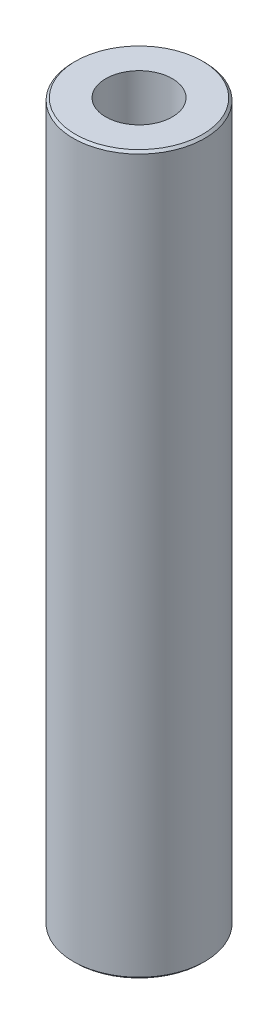
ISO-10303-21;
HEADER;
FILE_DESCRIPTION(('STEP AP214'),'2;1');
FILE_NAME('part.step','',(''),(''),'','','');
FILE_SCHEMA(('AUTOMOTIVE_DESIGN { 1 0 10303 214 1 1 1 1 }'));
ENDSEC;
DATA;
#1=APPLICATION_CONTEXT('core data for automotive mechanical design processes');
#2=APPLICATION_PROTOCOL_DEFINITION('international standard','automotive_design',2000,#1);
#3=PRODUCT_CONTEXT('',#1,'mechanical');
#4=PRODUCT('Part','Part','',(#3));
#5=PRODUCT_RELATED_PRODUCT_CATEGORY('part','',(#4));
#6=PRODUCT_DEFINITION_FORMATION('','',#4);
#7=PRODUCT_DEFINITION_CONTEXT('part definition',#1,'design');
#8=PRODUCT_DEFINITION('design','',#6,#7);
#9=PRODUCT_DEFINITION_SHAPE('','',#8);
#10=(LENGTH_UNIT() NAMED_UNIT(*) SI_UNIT(.MILLI.,.METRE.));
#11=(NAMED_UNIT(*) PLANE_ANGLE_UNIT() SI_UNIT($,.RADIAN.));
#12=(NAMED_UNIT(*) SI_UNIT($,.STERADIAN.) SOLID_ANGLE_UNIT());
#13=UNCERTAINTY_MEASURE_WITH_UNIT(LENGTH_MEASURE(1.E-05),#10,'distance_accuracy_value','');
#14=(GEOMETRIC_REPRESENTATION_CONTEXT(3) GLOBAL_UNCERTAINTY_ASSIGNED_CONTEXT((#13)) GLOBAL_UNIT_ASSIGNED_CONTEXT((#10,
#11,#12)) REPRESENTATION_CONTEXT('',''));
#15=CARTESIAN_POINT('',(0.,0.,0.));
#16=DIRECTION('',(0.,0.,1.));
#17=DIRECTION('',(1.,0.,0.));
#18=AXIS2_PLACEMENT_3D('',#15,#16,#17);
#19=CARTESIAN_POINT('',(0.,600.,0.));
#20=DIRECTION('',(0.,-1.,0.));
#21=DIRECTION('',(0.,0.,-1.));
#22=AXIS2_PLACEMENT_3D('',#19,#20,#21);
#23=CYLINDRICAL_SURFACE('',#22,55.);
#24=CARTESIAN_POINT('',(0.,598.094434389419,0.));
#25=DIRECTION('',(0.,1.,0.));
#26=DIRECTION('',(0.,0.,1.));
#27=AXIS2_PLACEMENT_3D('',#24,#25,#26);
#28=CIRCLE('',#27,55.);
#29=CARTESIAN_POINT('',(0.,598.094434389419,-55.0000000000001));
#30=VERTEX_POINT('',#29);
#31=EDGE_CURVE('E50',#30,#30,#28,.F.);
#32=ORIENTED_EDGE('',*,*,#31,.T.);
#33=EDGE_LOOP('',(#32));
#34=FACE_BOUND('',#33,.T.);
#35=CARTESIAN_POINT('',(0.,1.90556561058108,0.));
#36=DIRECTION('',(0.,1.,0.));
#37=DIRECTION('',(0.,0.,1.));
#38=AXIS2_PLACEMENT_3D('',#35,#36,#37);
#39=CIRCLE('',#38,55.);
#40=CARTESIAN_POINT('',(0.,1.90556561058108,55.));
#41=VERTEX_POINT('',#40);
#42=EDGE_CURVE('E51',#41,#41,#39,.T.);
#43=ORIENTED_EDGE('',*,*,#42,.T.);
#44=EDGE_LOOP('',(#43));
#45=FACE_BOUND('',#44,.T.);
#46=ADVANCED_FACE('F39',(#34,#45),#23,.T.);
#47=CARTESIAN_POINT('',(0.,600.,0.));
#48=DIRECTION('',(0.,1.,0.));
#49=DIRECTION('',(0.,0.,1.));
#50=AXIS2_PLACEMENT_3D('',#47,#48,#49);
#51=PLANE('',#50);
#52=CARTESIAN_POINT('',(0.,600.,0.));
#53=DIRECTION('',(0.,1.,0.));
#54=DIRECTION('',(0.,0.,1.));
#55=AXIS2_PLACEMENT_3D('',#52,#53,#54);
#56=CIRCLE('',#55,53.0944343894191);
#57=CARTESIAN_POINT('',(0.,600.,-53.0944343894192));
#58=VERTEX_POINT('',#57);
#59=EDGE_CURVE('E54',#58,#58,#56,.T.);
#60=ORIENTED_EDGE('',*,*,#59,.T.);
#61=EDGE_LOOP('',(#60));
#62=FACE_BOUND('',#61,.T.);
#63=CARTESIAN_POINT('',(0.,600.,0.));
#64=DIRECTION('',(0.,1.,0.));
#65=DIRECTION('',(0.,0.,1.));
#66=AXIS2_PLACEMENT_3D('',#63,#64,#65);
#67=CIRCLE('',#66,27.8159563151582);
#68=CARTESIAN_POINT('',(0.,600.,27.8159563151582));
#69=VERTEX_POINT('',#68);
#70=EDGE_CURVE('E58',#69,#69,#67,.T.);
#71=ORIENTED_EDGE('',*,*,#70,.F.);
#72=EDGE_LOOP('',(#71));
#73=FACE_BOUND('',#72,.T.);
#74=ADVANCED_FACE('F69',(#62,#73),#51,.T.);
#75=CARTESIAN_POINT('',(0.,0.,0.));
#76=DIRECTION('',(0.,1.,0.));
#77=DIRECTION('',(0.,0.,1.));
#78=AXIS2_PLACEMENT_3D('',#75,#76,#77);
#79=PLANE('',#78);
#80=CARTESIAN_POINT('',(0.,0.,0.));
#81=DIRECTION('',(0.,1.,0.));
#82=DIRECTION('',(0.,0.,1.));
#83=AXIS2_PLACEMENT_3D('',#80,#81,#82);
#84=CIRCLE('',#83,53.0944343894189);
#85=CARTESIAN_POINT('',(0.,0.,53.0944343894189));
#86=VERTEX_POINT('',#85);
#87=EDGE_CURVE('E10',#86,#86,#84,.F.);
#88=ORIENTED_EDGE('',*,*,#87,.T.);
#89=EDGE_LOOP('',(#88));
#90=FACE_BOUND('',#89,.T.);
#91=CARTESIAN_POINT('',(0.,0.,0.));
#92=DIRECTION('',(0.,1.,0.));
#93=DIRECTION('',(0.,0.,1.));
#94=AXIS2_PLACEMENT_3D('',#91,#92,#93);
#95=CIRCLE('',#94,27.8159563151582);
#96=CARTESIAN_POINT('',(0.,0.,27.8159563151582));
#97=VERTEX_POINT('',#96);
#98=EDGE_CURVE('E63',#97,#97,#95,.T.);
#99=ORIENTED_EDGE('',*,*,#98,.T.);
#100=EDGE_LOOP('',(#99));
#101=FACE_BOUND('',#100,.T.);
#102=ADVANCED_FACE('F75',(#90,#101),#79,.F.);
#103=CARTESIAN_POINT('',(0.,600.,0.));
#104=DIRECTION('',(0.,-1.,0.));
#105=DIRECTION('',(0.,0.,-1.));
#106=AXIS2_PLACEMENT_3D('',#103,#104,#105);
#107=CYLINDRICAL_SURFACE('',#106,27.8159563151582);
#108=ORIENTED_EDGE('',*,*,#70,.T.);
#109=EDGE_LOOP('',(#108));
#110=FACE_BOUND('',#109,.T.);
#111=ORIENTED_EDGE('',*,*,#98,.F.);
#112=EDGE_LOOP('',(#111));
#113=FACE_BOUND('',#112,.T.);
#114=ADVANCED_FACE('F70',(#110,#113),#107,.F.);
#115=CARTESIAN_POINT('',(0.,600.,0.));
#116=DIRECTION('',(0.,-1.,0.));
#117=DIRECTION('',(0.,0.,-1.));
#118=AXIS2_PLACEMENT_3D('',#115,#116,#117);
#119=CONICAL_SURFACE('',#118,53.0944343894191,0.78539816339745);
#120=CARTESIAN_POINT('',(0.,598.094434389419,-55.0000000000001));
#121=CARTESIAN_POINT('',(0.,598.114284031196,-54.9801503582232));
#122=CARTESIAN_POINT('',(0.,598.134133672973,-54.9603007164463));
#123=CARTESIAN_POINT('',(0.,598.173832956527,-54.9206014328925));
#124=CARTESIAN_POINT('',(0.,598.193682598303,-54.9007517911156));
#125=CARTESIAN_POINT('',(0.,598.233381881857,-54.8610525075619));
#126=CARTESIAN_POINT('',(0.,598.253231523634,-54.841202865785));
#127=CARTESIAN_POINT('',(0.,598.292930807188,-54.8015035822312));
#128=CARTESIAN_POINT('',(0.,598.312780448965,-54.7816539404543));
#129=CARTESIAN_POINT('',(0.,598.352479732519,-54.7419546569006));
#130=CARTESIAN_POINT('',(0.,598.372329374295,-54.7221050151237));
#131=CARTESIAN_POINT('',(0.,598.412028657849,-54.6824057315699));
#132=CARTESIAN_POINT('',(0.,598.431878299626,-54.662556089793));
#133=CARTESIAN_POINT('',(0.,598.47157758318,-54.6228568062393));
#134=CARTESIAN_POINT('',(0.,598.491427224957,-54.6030071644624));
#135=CARTESIAN_POINT('',(0.,598.531126508511,-54.5633078809086));
#136=CARTESIAN_POINT('',(0.,598.550976150287,-54.5434582391317));
#137=CARTESIAN_POINT('',(0.,598.590675433841,-54.503758955578));
#138=CARTESIAN_POINT('',(0.,598.610525075618,-54.4839093138011));
#139=CARTESIAN_POINT('',(0.,598.650224359172,-54.4442100302473));
#140=CARTESIAN_POINT('',(0.,598.670074000949,-54.4243603884704));
#141=CARTESIAN_POINT('',(0.,598.709773284502,-54.3846611049167));
#142=CARTESIAN_POINT('',(0.,598.729622926279,-54.3648114631398));
#143=CARTESIAN_POINT('',(0.,598.769322209833,-54.325112179586));
#144=CARTESIAN_POINT('',(0.,598.78917185161,-54.3052625378091));
#145=CARTESIAN_POINT('',(0.,598.828871135164,-54.2655632542553));
#146=CARTESIAN_POINT('',(0.,598.848720776941,-54.2457136124785));
#147=CARTESIAN_POINT('',(0.,598.888420060494,-54.2060143289247));
#148=CARTESIAN_POINT('',(0.,598.908269702271,-54.1861646871478));
#149=CARTESIAN_POINT('',(0.,598.947968985825,-54.146465403594));
#150=CARTESIAN_POINT('',(0.,598.967818627602,-54.1266157618172));
#151=CARTESIAN_POINT('',(0.,599.007517911156,-54.0869164782634));
#152=CARTESIAN_POINT('',(0.,599.027367552933,-54.0670668364865));
#153=CARTESIAN_POINT('',(0.,599.067066836486,-54.0273675529327));
#154=CARTESIAN_POINT('',(0.,599.086916478263,-54.0075179111558));
#155=CARTESIAN_POINT('',(0.,599.126615761817,-53.9678186276021));
#156=CARTESIAN_POINT('',(0.,599.146465403594,-53.9479689858252));
#157=CARTESIAN_POINT('',(0.,599.186164687148,-53.9082697022714));
#158=CARTESIAN_POINT('',(0.,599.206014328925,-53.8884200604945));
#159=CARTESIAN_POINT('',(0.,599.245713612478,-53.8487207769408));
#160=CARTESIAN_POINT('',(0.,599.265563254255,-53.8288711351639));
#161=CARTESIAN_POINT('',(0.,599.305262537809,-53.7891718516101));
#162=CARTESIAN_POINT('',(0.,599.325112179586,-53.7693222098332));
#163=CARTESIAN_POINT('',(0.,599.36481146314,-53.7296229262795));
#164=CARTESIAN_POINT('',(0.,599.384661104917,-53.7097732845026));
#165=CARTESIAN_POINT('',(0.,599.42436038847,-53.6700740009488));
#166=CARTESIAN_POINT('',(0.,599.444210030247,-53.6502243591719));
#167=CARTESIAN_POINT('',(0.,599.483909313801,-53.6105250756182));
#168=CARTESIAN_POINT('',(0.,599.503758955578,-53.5906754338413));
#169=CARTESIAN_POINT('',(0.,599.543458239132,-53.5509761502875));
#170=CARTESIAN_POINT('',(0.,599.563307880908,-53.5311265085106));
#171=CARTESIAN_POINT('',(0.,599.603007164462,-53.4914272249569));
#172=CARTESIAN_POINT('',(0.,599.622856806239,-53.47157758318));
#173=CARTESIAN_POINT('',(0.,599.662556089793,-53.4318782996262));
#174=CARTESIAN_POINT('',(0.,599.68240573157,-53.4120286578493));
#175=CARTESIAN_POINT('',(0.,599.722105015124,-53.3723293742956));
#176=CARTESIAN_POINT('',(0.,599.7419546569,-53.3524797325187));
#177=CARTESIAN_POINT('',(0.,599.781653940454,-53.3127804489649));
#178=CARTESIAN_POINT('',(0.,599.801503582231,-53.292930807188));
#179=CARTESIAN_POINT('',(0.,599.841202865785,-53.2532315236343));
#180=CARTESIAN_POINT('',(0.,599.861052507562,-53.2333818818574));
#181=CARTESIAN_POINT('',(0.,599.900751791116,-53.1936825983036));
#182=CARTESIAN_POINT('',(0.,599.920601432892,-53.1738329565267));
#183=CARTESIAN_POINT('',(0.,599.960300716446,-53.134133672973));
#184=CARTESIAN_POINT('',(0.,599.980150358223,-53.1142840311961));
#185=CARTESIAN_POINT('',(0.,600.,-53.0944343894192));
#186=B_SPLINE_CURVE_WITH_KNOTS('',3,(#120,#121,#122,#123,#124,#125,#126,#127,#128,#129,#130,
#131,#132,#133,#134,#135,#136,#137,#138,#139,#140,#141,#142,#143,#144,#145,#146,#147,#148,#149,
#150,#151,#152,#153,#154,#155,#156,#157,#158,#159,#160,#161,#162,#163,#164,#165,#166,#167,#168,
#169,#170,#171,#172,#173,#174,#175,#176,#177,#178,#179,#180,#181,#182,#183,#184,#185),
.UNSPECIFIED.,.F.,.F.,(4,2,2,2,2,2,2,2,2,2,2,2,2,2,2,2,2,2,2,2,2,2,2,2,2,2,2,2,2,2,2,2,4),(0.,
0.084214897827282,0.168429795654643,0.252644693482003,0.336859591309363,0.421074489136724,
0.505289386964085,0.589504284791445,0.673719182618805,0.757934080446088,0.842148978273448,
0.926363876100809,1.01057877392817,1.09479367175553,1.17900856958289,1.26322346741025,
1.34743836523762,1.4316532630649,1.51586816089226,1.60008305871962,1.68429795654698,
1.76851285437434,1.8527277522017,1.93694265002906,2.02115754785642,2.1053724456837,
2.18958734351106,2.27380224133842,2.35801713916578,2.44223203699315,2.52644693482051,
2.61066183264787,2.69487673047523),.UNSPECIFIED.);
#187=EDGE_CURVE('BSEAM81',#30,#58,#186,.T.);
#188=ORIENTED_EDGE('',*,*,#31,.F.);
#189=ORIENTED_EDGE('',*,*,#59,.F.);
#190=ORIENTED_EDGE('',*,*,#187,.T.);
#191=ORIENTED_EDGE('',*,*,#187,.F.);
#192=EDGE_LOOP('',(#188,#190,#189,#191));
#193=FACE_BOUND('',#192,.T.);
#194=ADVANCED_FACE('F81',(#193),#119,.T.);
#195=CARTESIAN_POINT('',(0.,1.90556561058108,0.));
#196=DIRECTION('',(0.,1.,0.));
#197=DIRECTION('',(0.,0.,1.));
#198=AXIS2_PLACEMENT_3D('',#195,#196,#197);
#199=CONICAL_SURFACE('',#198,55.,0.78539816339745);
#200=ORIENTED_EDGE('',*,*,#87,.F.);
#201=EDGE_LOOP('',(#200));
#202=FACE_BOUND('',#201,.T.);
#203=ORIENTED_EDGE('',*,*,#42,.F.);
#204=EDGE_LOOP('',(#203));
#205=FACE_BOUND('',#204,.T.);
#206=ADVANCED_FACE('F45',(#202,#205),#199,.T.);
#207=CLOSED_SHELL('',(#46,#74,#102,#114,#194,#206));
#208=MANIFOLD_SOLID_BREP('B2',#207);
#209=ADVANCED_BREP_SHAPE_REPRESENTATION('',(#18,#208),#14);
#210=SHAPE_DEFINITION_REPRESENTATION(#9,#209);
ENDSEC;
END-ISO-10303-21;
